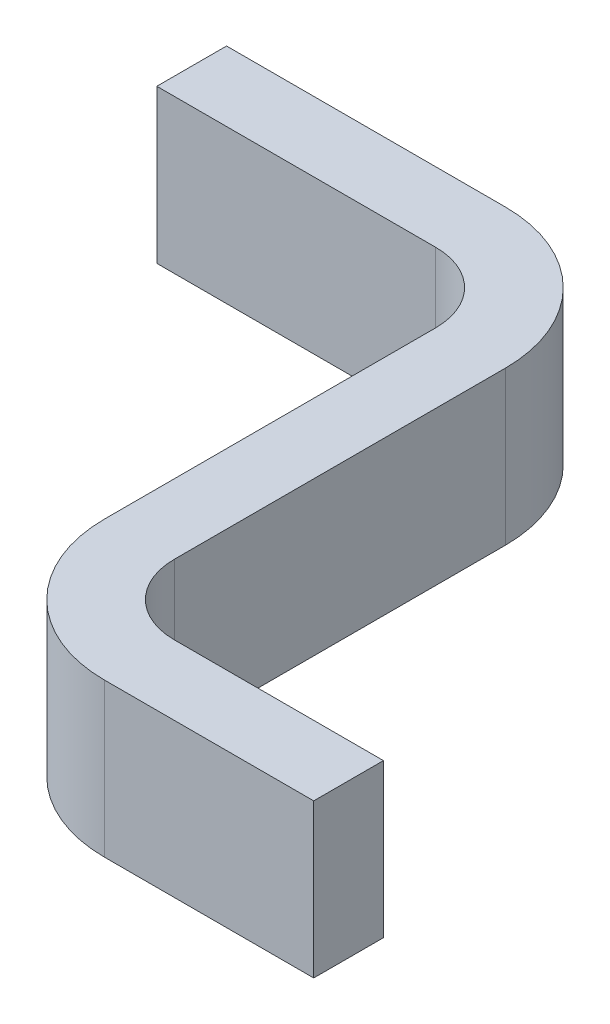
ISO-10303-21;
HEADER;
FILE_DESCRIPTION(('STEP AP214'),'2;1');
FILE_NAME('part.step','',(''),(''),'','','');
FILE_SCHEMA(('AUTOMOTIVE_DESIGN { 1 0 10303 214 1 1 1 1 }'));
ENDSEC;
DATA;
#1=APPLICATION_CONTEXT('core data for automotive mechanical design processes');
#2=APPLICATION_PROTOCOL_DEFINITION('international standard','automotive_design',2000,#1);
#3=PRODUCT_CONTEXT('',#1,'mechanical');
#4=PRODUCT('Part','Part','',(#3));
#5=PRODUCT_RELATED_PRODUCT_CATEGORY('part','',(#4));
#6=PRODUCT_DEFINITION_FORMATION('','',#4);
#7=PRODUCT_DEFINITION_CONTEXT('part definition',#1,'design');
#8=PRODUCT_DEFINITION('design','',#6,#7);
#9=PRODUCT_DEFINITION_SHAPE('','',#8);
#10=(LENGTH_UNIT() NAMED_UNIT(*) SI_UNIT(.MILLI.,.METRE.));
#11=(NAMED_UNIT(*) PLANE_ANGLE_UNIT() SI_UNIT($,.RADIAN.));
#12=(NAMED_UNIT(*) SI_UNIT($,.STERADIAN.) SOLID_ANGLE_UNIT());
#13=UNCERTAINTY_MEASURE_WITH_UNIT(LENGTH_MEASURE(1.E-05),#10,'distance_accuracy_value','');
#14=(GEOMETRIC_REPRESENTATION_CONTEXT(3) GLOBAL_UNCERTAINTY_ASSIGNED_CONTEXT((#13)) GLOBAL_UNIT_ASSIGNED_CONTEXT((#10,
#11,#12)) REPRESENTATION_CONTEXT('',''));
#15=CARTESIAN_POINT('',(0.,0.,0.));
#16=DIRECTION('',(0.,0.,1.));
#17=DIRECTION('',(1.,0.,0.));
#18=AXIS2_PLACEMENT_3D('',#15,#16,#17);
#19=CARTESIAN_POINT('',(-4.,0.36,0.675));
#20=DIRECTION('',(0.,-1.,0.));
#21=DIRECTION('',(1.,0.,0.));
#22=AXIS2_PLACEMENT_3D('',#19,#20,#21);
#23=PLANE('',#22);
#24=CARTESIAN_POINT('',(-3.8,0.36,0.675));
#25=DIRECTION('',(0.,1.,0.));
#26=DIRECTION('',(-1.,0.,0.));
#27=AXIS2_PLACEMENT_3D('',#24,#25,#26);
#28=CIRCLE('',#27,0.2);
#29=CARTESIAN_POINT('',(-3.8,0.36,0.875));
#30=VERTEX_POINT('',#29);
#31=CARTESIAN_POINT('',(-4.,0.36,0.675));
#32=VERTEX_POINT('',#31);
#33=EDGE_CURVE('E150',#30,#32,#28,.F.);
#34=ORIENTED_EDGE('',*,*,#33,.F.);
#35=DIRECTION('',(-1.,0.,0.));
#36=VECTOR('',#35,1.);
#37=CARTESIAN_POINT('',(-3.5,0.36,0.875));
#38=LINE('',#37,#36);
#39=CARTESIAN_POINT('',(-3.5,0.36,0.875));
#40=VERTEX_POINT('',#39);
#41=EDGE_CURVE('E147',#30,#40,#38,.F.);
#42=ORIENTED_EDGE('',*,*,#41,.T.);
#43=DIRECTION('',(0.,0.,1.));
#44=VECTOR('',#43,1.);
#45=CARTESIAN_POINT('',(-3.5,0.36,0.775));
#46=LINE('',#45,#44);
#47=CARTESIAN_POINT('',(-3.5,0.36,0.775));
#48=VERTEX_POINT('',#47);
#49=EDGE_CURVE('E141',#48,#40,#46,.T.);
#50=ORIENTED_EDGE('',*,*,#49,.F.);
#51=DIRECTION('',(1.,0.,0.));
#52=VECTOR('',#51,1.);
#53=CARTESIAN_POINT('',(-3.5,0.36,0.775));
#54=LINE('',#53,#52);
#55=CARTESIAN_POINT('',(-3.8,0.36,0.775));
#56=VERTEX_POINT('',#55);
#57=EDGE_CURVE('E115',#48,#56,#54,.F.);
#58=ORIENTED_EDGE('',*,*,#57,.T.);
#59=CARTESIAN_POINT('',(-3.8,0.36,0.675));
#60=DIRECTION('',(0.,1.,0.));
#61=DIRECTION('',(-1.,0.,0.));
#62=AXIS2_PLACEMENT_3D('',#59,#60,#61);
#63=CIRCLE('',#62,0.1);
#64=CARTESIAN_POINT('',(-3.9,0.36,0.675));
#65=VERTEX_POINT('',#64);
#66=EDGE_CURVE('E215',#56,#65,#63,.F.);
#67=ORIENTED_EDGE('',*,*,#66,.T.);
#68=DIRECTION('',(0.,0.,1.));
#69=VECTOR('',#68,1.);
#70=CARTESIAN_POINT('',(-3.9,0.36,0.675));
#71=LINE('',#70,#69);
#72=CARTESIAN_POINT('',(-3.9,0.36,0.2));
#73=VERTEX_POINT('',#72);
#74=EDGE_CURVE('E181',#65,#73,#71,.F.);
#75=ORIENTED_EDGE('',*,*,#74,.T.);
#76=CARTESIAN_POINT('',(-4.1,0.36,0.2));
#77=DIRECTION('',(0.,-1.,0.));
#78=DIRECTION('',(1.,0.,0.));
#79=AXIS2_PLACEMENT_3D('',#76,#77,#78);
#80=CIRCLE('',#79,0.2);
#81=CARTESIAN_POINT('',(-4.1,0.36,0.));
#82=VERTEX_POINT('',#81);
#83=EDGE_CURVE('E20',#82,#73,#80,.T.);
#84=ORIENTED_EDGE('',*,*,#83,.F.);
#85=DIRECTION('',(1.,0.,0.));
#86=VECTOR('',#85,1.);
#87=CARTESIAN_POINT('',(-4.1,0.36,0.));
#88=LINE('',#87,#86);
#89=CARTESIAN_POINT('',(-4.5,0.36,0.));
#90=VERTEX_POINT('',#89);
#91=EDGE_CURVE('E91',#82,#90,#88,.F.);
#92=ORIENTED_EDGE('',*,*,#91,.T.);
#93=DIRECTION('',(0.,0.,1.));
#94=VECTOR('',#93,1.);
#95=CARTESIAN_POINT('',(-4.5,0.36,0.));
#96=LINE('',#95,#94);
#97=CARTESIAN_POINT('',(-4.5,0.36,0.1));
#98=VERTEX_POINT('',#97);
#99=EDGE_CURVE('E163',#90,#98,#96,.T.);
#100=ORIENTED_EDGE('',*,*,#99,.T.);
#101=DIRECTION('',(-1.,0.,0.));
#102=VECTOR('',#101,1.);
#103=CARTESIAN_POINT('',(-4.1,0.36,0.1));
#104=LINE('',#103,#102);
#105=CARTESIAN_POINT('',(-4.1,0.36,0.1));
#106=VERTEX_POINT('',#105);
#107=EDGE_CURVE('E159',#98,#106,#104,.F.);
#108=ORIENTED_EDGE('',*,*,#107,.T.);
#109=CARTESIAN_POINT('',(-4.1,0.36,0.2));
#110=DIRECTION('',(0.,-1.,0.));
#111=DIRECTION('',(1.,0.,0.));
#112=AXIS2_PLACEMENT_3D('',#109,#110,#111);
#113=CIRCLE('',#112,0.1);
#114=CARTESIAN_POINT('',(-4.,0.36,0.2));
#115=VERTEX_POINT('',#114);
#116=EDGE_CURVE('E155',#106,#115,#113,.T.);
#117=ORIENTED_EDGE('',*,*,#116,.T.);
#118=DIRECTION('',(0.,0.,1.));
#119=VECTOR('',#118,1.);
#120=CARTESIAN_POINT('',(-4.,0.36,0.675));
#121=LINE('',#120,#119);
#122=EDGE_CURVE('E154',#115,#32,#121,.T.);
#123=ORIENTED_EDGE('',*,*,#122,.T.);
#124=EDGE_LOOP('',(#34,#42,#50,#58,#67,#75,#84,#92,#100,#108,#117,#123));
#125=FACE_BOUND('',#124,.T.);
#126=ADVANCED_FACE('F17',(#125),#23,.F.);
#127=CARTESIAN_POINT('',(-4.1,0.36,0.2));
#128=DIRECTION('',(0.,-1.,0.));
#129=DIRECTION('',(1.,0.,0.));
#130=AXIS2_PLACEMENT_3D('',#127,#128,#129);
#131=CYLINDRICAL_SURFACE('',#130,0.2);
#132=CARTESIAN_POINT('',(-4.1,0.14,0.2));
#133=DIRECTION('',(0.,-1.,0.));
#134=DIRECTION('',(1.,0.,0.));
#135=AXIS2_PLACEMENT_3D('',#132,#133,#134);
#136=CIRCLE('',#135,0.2);
#137=CARTESIAN_POINT('',(-3.9,0.14,0.2));
#138=VERTEX_POINT('',#137);
#139=CARTESIAN_POINT('',(-4.1,0.14,0.));
#140=VERTEX_POINT('',#139);
#141=EDGE_CURVE('E183',#138,#140,#136,.F.);
#142=ORIENTED_EDGE('',*,*,#141,.T.);
#143=DIRECTION('',(0.,1.,0.));
#144=VECTOR('',#143,1.);
#145=CARTESIAN_POINT('',(-4.1,0.36,0.));
#146=LINE('',#145,#144);
#147=EDGE_CURVE('E178',#140,#82,#146,.T.);
#148=ORIENTED_EDGE('',*,*,#147,.T.);
#149=ORIENTED_EDGE('',*,*,#83,.T.);
#150=DIRECTION('',(0.,-1.,0.));
#151=VECTOR('',#150,1.);
#152=CARTESIAN_POINT('',(-3.9,0.36,0.2));
#153=LINE('',#152,#151);
#154=EDGE_CURVE('E217',#73,#138,#153,.T.);
#155=ORIENTED_EDGE('',*,*,#154,.T.);
#156=EDGE_LOOP('',(#142,#148,#149,#155));
#157=FACE_BOUND('',#156,.T.);
#158=ADVANCED_FACE('F254',(#157),#131,.T.);
#159=CARTESIAN_POINT('',(-4.1,0.36,0.));
#160=DIRECTION('',(0.,0.,1.));
#161=DIRECTION('',(1.,0.,0.));
#162=AXIS2_PLACEMENT_3D('',#159,#160,#161);
#163=PLANE('',#162);
#164=ORIENTED_EDGE('',*,*,#147,.F.);
#165=DIRECTION('',(-1.,0.,0.));
#166=VECTOR('',#165,1.);
#167=CARTESIAN_POINT('',(-3.9,0.14,0.));
#168=LINE('',#167,#166);
#169=CARTESIAN_POINT('',(-4.5,0.14,0.));
#170=VERTEX_POINT('',#169);
#171=EDGE_CURVE('E170',#140,#170,#168,.T.);
#172=ORIENTED_EDGE('',*,*,#171,.T.);
#173=DIRECTION('',(0.,1.,0.));
#174=VECTOR('',#173,1.);
#175=CARTESIAN_POINT('',(-4.5,0.36,0.));
#176=LINE('',#175,#174);
#177=EDGE_CURVE('E173',#170,#90,#176,.T.);
#178=ORIENTED_EDGE('',*,*,#177,.T.);
#179=ORIENTED_EDGE('',*,*,#91,.F.);
#180=EDGE_LOOP('',(#164,#172,#178,#179));
#181=FACE_BOUND('',#180,.T.);
#182=ADVANCED_FACE('F257',(#181),#163,.F.);
#183=CARTESIAN_POINT('',(-4.5,0.36,0.));
#184=DIRECTION('',(1.,0.,0.));
#185=DIRECTION('',(0.,1.,0.));
#186=AXIS2_PLACEMENT_3D('',#183,#184,#185);
#187=PLANE('',#186);
#188=DIRECTION('',(0.,1.,0.));
#189=VECTOR('',#188,1.);
#190=CARTESIAN_POINT('',(-4.5,0.14,0.1));
#191=LINE('',#190,#189);
#192=CARTESIAN_POINT('',(-4.5,0.14,0.1));
#193=VERTEX_POINT('',#192);
#194=EDGE_CURVE('E160',#193,#98,#191,.T.);
#195=ORIENTED_EDGE('',*,*,#194,.T.);
#196=ORIENTED_EDGE('',*,*,#99,.F.);
#197=ORIENTED_EDGE('',*,*,#177,.F.);
#198=DIRECTION('',(0.,0.,1.));
#199=VECTOR('',#198,1.);
#200=CARTESIAN_POINT('',(-4.5,0.14,0.675));
#201=LINE('',#200,#199);
#202=EDGE_CURVE('E166',#170,#193,#201,.T.);
#203=ORIENTED_EDGE('',*,*,#202,.T.);
#204=EDGE_LOOP('',(#195,#196,#197,#203));
#205=FACE_BOUND('',#204,.T.);
#206=ADVANCED_FACE('F259',(#205),#187,.F.);
#207=CARTESIAN_POINT('',(-4.1,0.14,0.1));
#208=DIRECTION('',(0.,0.,-1.));
#209=DIRECTION('',(-1.,0.,0.));
#210=AXIS2_PLACEMENT_3D('',#207,#208,#209);
#211=PLANE('',#210);
#212=DIRECTION('',(0.,-1.,0.));
#213=VECTOR('',#212,1.);
#214=CARTESIAN_POINT('',(-4.1,0.14,0.1));
#215=LINE('',#214,#213);
#216=CARTESIAN_POINT('',(-4.1,0.14,0.1));
#217=VERTEX_POINT('',#216);
#218=EDGE_CURVE('E156',#217,#106,#215,.F.);
#219=ORIENTED_EDGE('',*,*,#218,.T.);
#220=ORIENTED_EDGE('',*,*,#107,.F.);
#221=ORIENTED_EDGE('',*,*,#194,.F.);
#222=DIRECTION('',(-1.,0.,0.));
#223=VECTOR('',#222,1.);
#224=CARTESIAN_POINT('',(-3.9,0.14,0.1));
#225=LINE('',#224,#223);
#226=EDGE_CURVE('E169',#193,#217,#225,.F.);
#227=ORIENTED_EDGE('',*,*,#226,.T.);
#228=EDGE_LOOP('',(#219,#220,#221,#227));
#229=FACE_BOUND('',#228,.T.);
#230=ADVANCED_FACE('F234',(#229),#211,.F.);
#231=CARTESIAN_POINT('',(-4.1,0.14,0.2));
#232=DIRECTION('',(0.,-1.,0.));
#233=DIRECTION('',(1.,0.,0.));
#234=AXIS2_PLACEMENT_3D('',#231,#232,#233);
#235=CYLINDRICAL_SURFACE('',#234,0.1);
#236=DIRECTION('',(0.,1.,0.));
#237=VECTOR('',#236,1.);
#238=CARTESIAN_POINT('',(-4.,0.14,0.2));
#239=LINE('',#238,#237);
#240=CARTESIAN_POINT('',(-4.,0.14,0.2));
#241=VERTEX_POINT('',#240);
#242=EDGE_CURVE('E151',#241,#115,#239,.T.);
#243=ORIENTED_EDGE('',*,*,#242,.T.);
#244=ORIENTED_EDGE('',*,*,#116,.F.);
#245=ORIENTED_EDGE('',*,*,#218,.F.);
#246=CARTESIAN_POINT('',(-4.1,0.14,0.2));
#247=DIRECTION('',(0.,-1.,0.));
#248=DIRECTION('',(1.,0.,0.));
#249=AXIS2_PLACEMENT_3D('',#246,#247,#248);
#250=CIRCLE('',#249,0.1);
#251=EDGE_CURVE('E210',#217,#241,#250,.T.);
#252=ORIENTED_EDGE('',*,*,#251,.T.);
#253=EDGE_LOOP('',(#243,#244,#245,#252));
#254=FACE_BOUND('',#253,.T.);
#255=ADVANCED_FACE('F227',(#254),#235,.F.);
#256=CARTESIAN_POINT('',(-4.,0.14,0.675));
#257=DIRECTION('',(1.,0.,0.));
#258=DIRECTION('',(0.,1.,0.));
#259=AXIS2_PLACEMENT_3D('',#256,#257,#258);
#260=PLANE('',#259);
#261=DIRECTION('',(0.,1.,0.));
#262=VECTOR('',#261,1.);
#263=CARTESIAN_POINT('',(-4.,0.14,0.675));
#264=LINE('',#263,#262);
#265=CARTESIAN_POINT('',(-4.,0.14,0.675));
#266=VERTEX_POINT('',#265);
#267=EDGE_CURVE('E148',#32,#266,#264,.F.);
#268=ORIENTED_EDGE('',*,*,#267,.F.);
#269=ORIENTED_EDGE('',*,*,#122,.F.);
#270=ORIENTED_EDGE('',*,*,#242,.F.);
#271=DIRECTION('',(0.,0.,1.));
#272=VECTOR('',#271,1.);
#273=CARTESIAN_POINT('',(-4.,0.14,0.675));
#274=LINE('',#273,#272);
#275=EDGE_CURVE('E209',#241,#266,#274,.T.);
#276=ORIENTED_EDGE('',*,*,#275,.T.);
#277=EDGE_LOOP('',(#268,#269,#270,#276));
#278=FACE_BOUND('',#277,.T.);
#279=ADVANCED_FACE('F224',(#278),#260,.F.);
#280=CARTESIAN_POINT('',(-3.8,0.14,0.675));
#281=DIRECTION('',(0.,1.,0.));
#282=DIRECTION('',(-1.,0.,0.));
#283=AXIS2_PLACEMENT_3D('',#280,#281,#282);
#284=CYLINDRICAL_SURFACE('',#283,0.2);
#285=ORIENTED_EDGE('',*,*,#33,.T.);
#286=ORIENTED_EDGE('',*,*,#267,.T.);
#287=CARTESIAN_POINT('',(-3.8,0.14,0.675));
#288=DIRECTION('',(0.,1.,0.));
#289=DIRECTION('',(-1.,0.,0.));
#290=AXIS2_PLACEMENT_3D('',#287,#288,#289);
#291=CIRCLE('',#290,0.2);
#292=CARTESIAN_POINT('',(-3.8,0.14,0.875));
#293=VERTEX_POINT('',#292);
#294=EDGE_CURVE('E133',#266,#293,#291,.T.);
#295=ORIENTED_EDGE('',*,*,#294,.T.);
#296=DIRECTION('',(0.,1.,0.));
#297=VECTOR('',#296,1.);
#298=CARTESIAN_POINT('',(-3.8,0.14,0.875));
#299=LINE('',#298,#297);
#300=EDGE_CURVE('E144',#293,#30,#299,.T.);
#301=ORIENTED_EDGE('',*,*,#300,.T.);
#302=EDGE_LOOP('',(#285,#286,#295,#301));
#303=FACE_BOUND('',#302,.T.);
#304=ADVANCED_FACE('F285',(#303),#284,.T.);
#305=CARTESIAN_POINT('',(-3.5,0.14,0.875));
#306=DIRECTION('',(0.,0.,-1.));
#307=DIRECTION('',(-1.,0.,0.));
#308=AXIS2_PLACEMENT_3D('',#305,#306,#307);
#309=PLANE('',#308);
#310=DIRECTION('',(0.,1.,0.));
#311=VECTOR('',#310,1.);
#312=CARTESIAN_POINT('',(-3.5,0.36,0.875));
#313=LINE('',#312,#311);
#314=CARTESIAN_POINT('',(-3.5,0.14,0.875));
#315=VERTEX_POINT('',#314);
#316=EDGE_CURVE('E118',#40,#315,#313,.F.);
#317=ORIENTED_EDGE('',*,*,#316,.F.);
#318=ORIENTED_EDGE('',*,*,#41,.F.);
#319=ORIENTED_EDGE('',*,*,#300,.F.);
#320=DIRECTION('',(-1.,0.,0.));
#321=VECTOR('',#320,1.);
#322=CARTESIAN_POINT('',(-3.9,0.14,0.875));
#323=LINE('',#322,#321);
#324=EDGE_CURVE('E131',#293,#315,#323,.F.);
#325=ORIENTED_EDGE('',*,*,#324,.T.);
#326=EDGE_LOOP('',(#317,#318,#319,#325));
#327=FACE_BOUND('',#326,.T.);
#328=ADVANCED_FACE('F282',(#327),#309,.F.);
#329=CARTESIAN_POINT('',(-3.5,0.36,0.775));
#330=DIRECTION('',(1.,0.,0.));
#331=DIRECTION('',(0.,1.,0.));
#332=AXIS2_PLACEMENT_3D('',#329,#330,#331);
#333=PLANE('',#332);
#334=ORIENTED_EDGE('',*,*,#49,.T.);
#335=ORIENTED_EDGE('',*,*,#316,.T.);
#336=DIRECTION('',(0.,0.,1.));
#337=VECTOR('',#336,1.);
#338=CARTESIAN_POINT('',(-3.5,0.14,0.675));
#339=LINE('',#338,#337);
#340=CARTESIAN_POINT('',(-3.5,0.14,0.775));
#341=VERTEX_POINT('',#340);
#342=EDGE_CURVE('E125',#315,#341,#339,.F.);
#343=ORIENTED_EDGE('',*,*,#342,.T.);
#344=DIRECTION('',(0.,1.,0.));
#345=VECTOR('',#344,1.);
#346=CARTESIAN_POINT('',(-3.5,0.36,0.775));
#347=LINE('',#346,#345);
#348=EDGE_CURVE('E110',#341,#48,#347,.T.);
#349=ORIENTED_EDGE('',*,*,#348,.T.);
#350=EDGE_LOOP('',(#334,#335,#343,#349));
#351=FACE_BOUND('',#350,.T.);
#352=ADVANCED_FACE('F129',(#351),#333,.T.);
#353=CARTESIAN_POINT('',(-3.5,0.36,0.775));
#354=DIRECTION('',(0.,0.,1.));
#355=DIRECTION('',(1.,0.,0.));
#356=AXIS2_PLACEMENT_3D('',#353,#354,#355);
#357=PLANE('',#356);
#358=ORIENTED_EDGE('',*,*,#348,.F.);
#359=DIRECTION('',(-1.,0.,0.));
#360=VECTOR('',#359,1.);
#361=CARTESIAN_POINT('',(-3.9,0.14,0.775));
#362=LINE('',#361,#360);
#363=CARTESIAN_POINT('',(-3.8,0.14,0.775));
#364=VERTEX_POINT('',#363);
#365=EDGE_CURVE('E114',#341,#364,#362,.T.);
#366=ORIENTED_EDGE('',*,*,#365,.T.);
#367=DIRECTION('',(0.,1.,0.));
#368=VECTOR('',#367,1.);
#369=CARTESIAN_POINT('',(-3.8,0.36,0.775));
#370=LINE('',#369,#368);
#371=EDGE_CURVE('E185',#364,#56,#370,.T.);
#372=ORIENTED_EDGE('',*,*,#371,.T.);
#373=ORIENTED_EDGE('',*,*,#57,.F.);
#374=EDGE_LOOP('',(#358,#366,#372,#373));
#375=FACE_BOUND('',#374,.T.);
#376=ADVANCED_FACE('F112',(#375),#357,.F.);
#377=CARTESIAN_POINT('',(-3.8,0.36,0.675));
#378=DIRECTION('',(0.,1.,0.));
#379=DIRECTION('',(-1.,0.,0.));
#380=AXIS2_PLACEMENT_3D('',#377,#378,#379);
#381=CYLINDRICAL_SURFACE('',#380,0.1);
#382=ORIENTED_EDGE('',*,*,#371,.F.);
#383=CARTESIAN_POINT('',(-3.8,0.14,0.675));
#384=DIRECTION('',(0.,1.,0.));
#385=DIRECTION('',(-1.,0.,0.));
#386=AXIS2_PLACEMENT_3D('',#383,#384,#385);
#387=CIRCLE('',#386,0.1);
#388=CARTESIAN_POINT('',(-3.9,0.14,0.675));
#389=VERTEX_POINT('',#388);
#390=EDGE_CURVE('E26',#364,#389,#387,.F.);
#391=ORIENTED_EDGE('',*,*,#390,.T.);
#392=DIRECTION('',(0.,-1.,0.));
#393=VECTOR('',#392,1.);
#394=CARTESIAN_POINT('',(-3.9,0.36,0.675));
#395=LINE('',#394,#393);
#396=EDGE_CURVE('E34',#389,#65,#395,.F.);
#397=ORIENTED_EDGE('',*,*,#396,.T.);
#398=ORIENTED_EDGE('',*,*,#66,.F.);
#399=EDGE_LOOP('',(#382,#391,#397,#398));
#400=FACE_BOUND('',#399,.T.);
#401=ADVANCED_FACE('F250',(#400),#381,.F.);
#402=CARTESIAN_POINT('',(-3.9,0.36,0.675));
#403=DIRECTION('',(-1.,0.,0.));
#404=DIRECTION('',(0.,-1.,0.));
#405=AXIS2_PLACEMENT_3D('',#402,#403,#404);
#406=PLANE('',#405);
#407=ORIENTED_EDGE('',*,*,#396,.F.);
#408=DIRECTION('',(0.,0.,1.));
#409=VECTOR('',#408,1.);
#410=CARTESIAN_POINT('',(-3.9,0.14,0.675));
#411=LINE('',#410,#409);
#412=EDGE_CURVE('E11',#389,#138,#411,.F.);
#413=ORIENTED_EDGE('',*,*,#412,.T.);
#414=ORIENTED_EDGE('',*,*,#154,.F.);
#415=ORIENTED_EDGE('',*,*,#74,.F.);
#416=EDGE_LOOP('',(#407,#413,#414,#415));
#417=FACE_BOUND('',#416,.T.);
#418=ADVANCED_FACE('F252',(#417),#406,.F.);
#419=CARTESIAN_POINT('',(-3.9,0.14,0.675));
#420=DIRECTION('',(0.,1.,0.));
#421=DIRECTION('',(-1.,0.,0.));
#422=AXIS2_PLACEMENT_3D('',#419,#420,#421);
#423=PLANE('',#422);
#424=ORIENTED_EDGE('',*,*,#390,.F.);
#425=ORIENTED_EDGE('',*,*,#365,.F.);
#426=ORIENTED_EDGE('',*,*,#342,.F.);
#427=ORIENTED_EDGE('',*,*,#324,.F.);
#428=ORIENTED_EDGE('',*,*,#294,.F.);
#429=ORIENTED_EDGE('',*,*,#275,.F.);
#430=ORIENTED_EDGE('',*,*,#251,.F.);
#431=ORIENTED_EDGE('',*,*,#226,.F.);
#432=ORIENTED_EDGE('',*,*,#202,.F.);
#433=ORIENTED_EDGE('',*,*,#171,.F.);
#434=ORIENTED_EDGE('',*,*,#141,.F.);
#435=ORIENTED_EDGE('',*,*,#412,.F.);
#436=EDGE_LOOP('',(#424,#425,#426,#427,#428,#429,#430,#431,#432,#433,#434,#435));
#437=FACE_BOUND('',#436,.T.);
#438=ADVANCED_FACE('F123',(#437),#423,.F.);
#439=CLOSED_SHELL('',(#126,#158,#182,#206,#230,#255,#279,#304,#328,#352,#376,#401,#418,#438));
#440=MANIFOLD_SOLID_BREP('B1',#439);
#441=ADVANCED_BREP_SHAPE_REPRESENTATION('',(#18,#440),#14);
#442=SHAPE_DEFINITION_REPRESENTATION(#9,#441);
ENDSEC;
END-ISO-10303-21;
